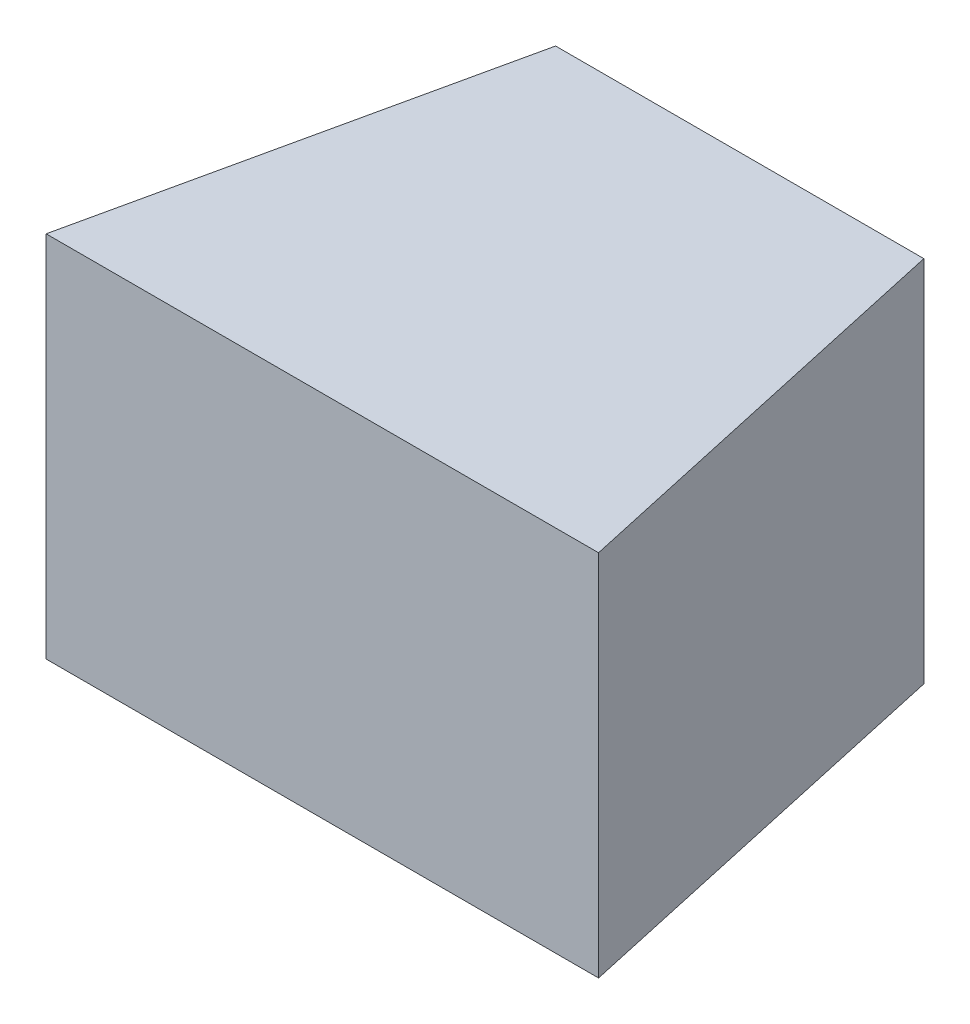
ISO-10303-21;
HEADER;
FILE_DESCRIPTION(('STEP AP214'),'2;1');
FILE_NAME('part.step','',(''),(''),'','','');
FILE_SCHEMA(('AUTOMOTIVE_DESIGN { 1 0 10303 214 1 1 1 1 }'));
ENDSEC;
DATA;
#1=APPLICATION_CONTEXT('core data for automotive mechanical design processes');
#2=APPLICATION_PROTOCOL_DEFINITION('international standard','automotive_design',2000,#1);
#3=PRODUCT_CONTEXT('',#1,'mechanical');
#4=PRODUCT('Part','Part','',(#3));
#5=PRODUCT_RELATED_PRODUCT_CATEGORY('part','',(#4));
#6=PRODUCT_DEFINITION_FORMATION('','',#4);
#7=PRODUCT_DEFINITION_CONTEXT('part definition',#1,'design');
#8=PRODUCT_DEFINITION('design','',#6,#7);
#9=PRODUCT_DEFINITION_SHAPE('','',#8);
#10=(LENGTH_UNIT() NAMED_UNIT(*) SI_UNIT(.MILLI.,.METRE.));
#11=(NAMED_UNIT(*) PLANE_ANGLE_UNIT() SI_UNIT($,.RADIAN.));
#12=(NAMED_UNIT(*) SI_UNIT($,.STERADIAN.) SOLID_ANGLE_UNIT());
#13=UNCERTAINTY_MEASURE_WITH_UNIT(LENGTH_MEASURE(1.E-05),#10,'distance_accuracy_value','');
#14=(GEOMETRIC_REPRESENTATION_CONTEXT(3) GLOBAL_UNCERTAINTY_ASSIGNED_CONTEXT((#13)) GLOBAL_UNIT_ASSIGNED_CONTEXT((#10,
#11,#12)) REPRESENTATION_CONTEXT('',''));
#15=CARTESIAN_POINT('',(0.,0.,0.));
#16=DIRECTION('',(0.,0.,1.));
#17=DIRECTION('',(1.,0.,0.));
#18=AXIS2_PLACEMENT_3D('',#15,#16,#17);
#19=CARTESIAN_POINT('',(0.,30.,17.));
#20=DIRECTION('',(0.,0.,-1.));
#21=DIRECTION('',(-1.,0.,0.));
#22=AXIS2_PLACEMENT_3D('',#19,#20,#21);
#23=PLANE('',#22);
#24=DIRECTION('',(1.,0.,0.));
#25=VECTOR('',#24,1.);
#26=CARTESIAN_POINT('',(0.,0.,17.));
#27=LINE('',#26,#25);
#28=CARTESIAN_POINT('',(-22.5,0.,17.));
#29=VERTEX_POINT('',#28);
#30=CARTESIAN_POINT('',(22.5,0.,17.));
#31=VERTEX_POINT('',#30);
#32=EDGE_CURVE('E102',#29,#31,#27,.T.);
#33=ORIENTED_EDGE('',*,*,#32,.T.);
#34=DIRECTION('',(0.,-1.,0.));
#35=VECTOR('',#34,1.);
#36=CARTESIAN_POINT('',(22.5,30.,17.));
#37=LINE('',#36,#35);
#38=CARTESIAN_POINT('',(22.5,30.,17.));
#39=VERTEX_POINT('',#38);
#40=EDGE_CURVE('E11',#39,#31,#37,.T.);
#41=ORIENTED_EDGE('',*,*,#40,.F.);
#42=DIRECTION('',(1.,0.,0.));
#43=VECTOR('',#42,1.);
#44=CARTESIAN_POINT('',(0.,30.,17.));
#45=LINE('',#44,#43);
#46=CARTESIAN_POINT('',(-22.5,30.,17.));
#47=VERTEX_POINT('',#46);
#48=EDGE_CURVE('E88',#47,#39,#45,.T.);
#49=ORIENTED_EDGE('',*,*,#48,.F.);
#50=DIRECTION('',(0.,-1.,0.));
#51=VECTOR('',#50,1.);
#52=CARTESIAN_POINT('',(-22.5,30.,17.));
#53=LINE('',#52,#51);
#54=EDGE_CURVE('E55',#47,#29,#53,.T.);
#55=ORIENTED_EDGE('',*,*,#54,.T.);
#56=EDGE_LOOP('',(#33,#41,#49,#55));
#57=FACE_BOUND('',#56,.T.);
#58=ADVANCED_FACE('F39',(#57),#23,.F.);
#59=CARTESIAN_POINT('',(17.8799752526294,30.,-3.94411218808002));
#60=DIRECTION('',(-0.976523773463931,0.,0.215409655911161));
#61=DIRECTION('',(0.215409655911161,0.,0.976523773463931));
#62=AXIS2_PLACEMENT_3D('',#59,#60,#61);
#63=PLANE('',#62);
#64=DIRECTION('',(-0.215409655911161,0.,-0.976523773463931));
#65=VECTOR('',#64,1.);
#66=CARTESIAN_POINT('',(17.8799752526294,0.,-3.94411218808002));
#67=LINE('',#66,#65);
#68=CARTESIAN_POINT('',(15.,0.,-17.));
#69=VERTEX_POINT('',#68);
#70=EDGE_CURVE('E93',#31,#69,#67,.T.);
#71=ORIENTED_EDGE('',*,*,#70,.T.);
#72=DIRECTION('',(0.,-1.,0.));
#73=VECTOR('',#72,1.);
#74=CARTESIAN_POINT('',(15.,30.,-17.));
#75=LINE('',#74,#73);
#76=CARTESIAN_POINT('',(15.,30.,-17.));
#77=VERTEX_POINT('',#76);
#78=EDGE_CURVE('E47',#77,#69,#75,.T.);
#79=ORIENTED_EDGE('',*,*,#78,.F.);
#80=DIRECTION('',(-0.215409655911161,0.,-0.976523773463931));
#81=VECTOR('',#80,1.);
#82=CARTESIAN_POINT('',(17.8799752526294,30.,-3.94411218808002));
#83=LINE('',#82,#81);
#84=EDGE_CURVE('E80',#39,#77,#83,.T.);
#85=ORIENTED_EDGE('',*,*,#84,.F.);
#86=ORIENTED_EDGE('',*,*,#40,.T.);
#87=EDGE_LOOP('',(#71,#79,#85,#86));
#88=FACE_BOUND('',#87,.T.);
#89=ADVANCED_FACE('F92',(#88),#63,.F.);
#90=CARTESIAN_POINT('',(0.,30.,-17.));
#91=DIRECTION('',(0.,0.,-1.));
#92=DIRECTION('',(-1.,0.,0.));
#93=AXIS2_PLACEMENT_3D('',#90,#91,#92);
#94=PLANE('',#93);
#95=DIRECTION('',(1.,0.,0.));
#96=VECTOR('',#95,1.);
#97=CARTESIAN_POINT('',(0.,0.,-17.));
#98=LINE('',#97,#96);
#99=CARTESIAN_POINT('',(-15.,0.,-17.));
#100=VERTEX_POINT('',#99);
#101=EDGE_CURVE('E105',#100,#69,#98,.T.);
#102=ORIENTED_EDGE('',*,*,#101,.F.);
#103=DIRECTION('',(0.,-1.,0.));
#104=VECTOR('',#103,1.);
#105=CARTESIAN_POINT('',(-15.,30.,-17.));
#106=LINE('',#105,#104);
#107=CARTESIAN_POINT('',(-15.,30.,-17.));
#108=VERTEX_POINT('',#107);
#109=EDGE_CURVE('E69',#108,#100,#106,.T.);
#110=ORIENTED_EDGE('',*,*,#109,.F.);
#111=DIRECTION('',(1.,0.,0.));
#112=VECTOR('',#111,1.);
#113=CARTESIAN_POINT('',(0.,30.,-17.));
#114=LINE('',#113,#112);
#115=EDGE_CURVE('E87',#108,#77,#114,.T.);
#116=ORIENTED_EDGE('',*,*,#115,.T.);
#117=ORIENTED_EDGE('',*,*,#78,.T.);
#118=EDGE_LOOP('',(#102,#110,#116,#117));
#119=FACE_BOUND('',#118,.T.);
#120=ADVANCED_FACE('F96',(#119),#94,.T.);
#121=CARTESIAN_POINT('',(-17.8799752526294,30.,-3.94411218808001));
#122=DIRECTION('',(-0.976523773463931,0.,-0.215409655911161));
#123=DIRECTION('',(-0.215409655911161,0.,0.976523773463931));
#124=AXIS2_PLACEMENT_3D('',#121,#122,#123);
#125=PLANE('',#124);
#126=DIRECTION('',(0.215409655911161,0.,-0.976523773463931));
#127=VECTOR('',#126,1.);
#128=CARTESIAN_POINT('',(-17.8799752526294,0.,-3.94411218808001));
#129=LINE('',#128,#127);
#130=EDGE_CURVE('E107',#29,#100,#129,.T.);
#131=ORIENTED_EDGE('',*,*,#130,.F.);
#132=ORIENTED_EDGE('',*,*,#54,.F.);
#133=DIRECTION('',(0.215409655911161,0.,-0.976523773463931));
#134=VECTOR('',#133,1.);
#135=CARTESIAN_POINT('',(-17.8799752526294,30.,-3.94411218808001));
#136=LINE('',#135,#134);
#137=EDGE_CURVE('E97',#47,#108,#136,.T.);
#138=ORIENTED_EDGE('',*,*,#137,.T.);
#139=ORIENTED_EDGE('',*,*,#109,.T.);
#140=EDGE_LOOP('',(#131,#132,#138,#139));
#141=FACE_BOUND('',#140,.T.);
#142=ADVANCED_FACE('F113',(#141),#125,.T.);
#143=CARTESIAN_POINT('',(0.,30.,0.));
#144=DIRECTION('',(0.,1.,0.));
#145=DIRECTION('',(0.,0.,1.));
#146=AXIS2_PLACEMENT_3D('',#143,#144,#145);
#147=PLANE('',#146);
#148=ORIENTED_EDGE('',*,*,#48,.T.);
#149=ORIENTED_EDGE('',*,*,#84,.T.);
#150=ORIENTED_EDGE('',*,*,#115,.F.);
#151=ORIENTED_EDGE('',*,*,#137,.F.);
#152=EDGE_LOOP('',(#148,#149,#150,#151));
#153=FACE_BOUND('',#152,.T.);
#154=ADVANCED_FACE('F84',(#153),#147,.T.);
#155=CARTESIAN_POINT('',(0.,0.,0.));
#156=DIRECTION('',(0.,1.,0.));
#157=DIRECTION('',(0.,0.,1.));
#158=AXIS2_PLACEMENT_3D('',#155,#156,#157);
#159=PLANE('',#158);
#160=ORIENTED_EDGE('',*,*,#32,.F.);
#161=ORIENTED_EDGE('',*,*,#130,.T.);
#162=ORIENTED_EDGE('',*,*,#101,.T.);
#163=ORIENTED_EDGE('',*,*,#70,.F.);
#164=EDGE_LOOP('',(#160,#161,#162,#163));
#165=FACE_BOUND('',#164,.T.);
#166=ADVANCED_FACE('F112',(#165),#159,.F.);
#167=CLOSED_SHELL('',(#58,#89,#120,#142,#154,#166));
#168=MANIFOLD_SOLID_BREP('B2',#167);
#169=ADVANCED_BREP_SHAPE_REPRESENTATION('',(#18,#168),#14);
#170=SHAPE_DEFINITION_REPRESENTATION(#9,#169);
ENDSEC;
END-ISO-10303-21;
